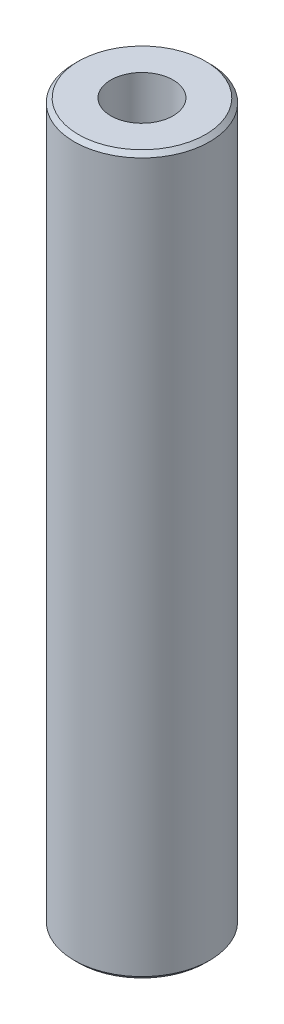
ISO-10303-21;
HEADER;
FILE_DESCRIPTION(('STEP AP214'),'2;1');
FILE_NAME('part.step','',(''),(''),'','','');
FILE_SCHEMA(('AUTOMOTIVE_DESIGN { 1 0 10303 214 1 1 1 1 }'));
ENDSEC;
DATA;
#1=APPLICATION_CONTEXT('core data for automotive mechanical design processes');
#2=APPLICATION_PROTOCOL_DEFINITION('international standard','automotive_design',2000,#1);
#3=PRODUCT_CONTEXT('',#1,'mechanical');
#4=PRODUCT('Part','Part','',(#3));
#5=PRODUCT_RELATED_PRODUCT_CATEGORY('part','',(#4));
#6=PRODUCT_DEFINITION_FORMATION('','',#4);
#7=PRODUCT_DEFINITION_CONTEXT('part definition',#1,'design');
#8=PRODUCT_DEFINITION('design','',#6,#7);
#9=PRODUCT_DEFINITION_SHAPE('','',#8);
#10=(LENGTH_UNIT() NAMED_UNIT(*) SI_UNIT(.MILLI.,.METRE.));
#11=(NAMED_UNIT(*) PLANE_ANGLE_UNIT() SI_UNIT($,.RADIAN.));
#12=(NAMED_UNIT(*) SI_UNIT($,.STERADIAN.) SOLID_ANGLE_UNIT());
#13=UNCERTAINTY_MEASURE_WITH_UNIT(LENGTH_MEASURE(1.E-05),#10,'distance_accuracy_value','');
#14=(GEOMETRIC_REPRESENTATION_CONTEXT(3) GLOBAL_UNCERTAINTY_ASSIGNED_CONTEXT((#13)) GLOBAL_UNIT_ASSIGNED_CONTEXT((#10,
#11,#12)) REPRESENTATION_CONTEXT('',''));
#15=CARTESIAN_POINT('',(0.,0.,0.));
#16=DIRECTION('',(0.,0.,1.));
#17=DIRECTION('',(1.,0.,0.));
#18=AXIS2_PLACEMENT_3D('',#15,#16,#17);
#19=CARTESIAN_POINT('',(0.,582.553141540625,0.));
#20=DIRECTION('',(0.,-1.,0.));
#21=DIRECTION('',(0.,0.,-1.));
#22=AXIS2_PLACEMENT_3D('',#19,#20,#21);
#23=CYLINDRICAL_SURFACE('',#22,55.);
#24=CARTESIAN_POINT('',(0.,579.159147282442,0.));
#25=DIRECTION('',(0.,1.,0.));
#26=DIRECTION('',(0.,0.,1.));
#27=AXIS2_PLACEMENT_3D('',#24,#25,#26);
#28=CIRCLE('',#27,55.);
#29=CARTESIAN_POINT('',(0.,579.159147282442,55.));
#30=VERTEX_POINT('',#29);
#31=EDGE_CURVE('E50',#30,#30,#28,.F.);
#32=ORIENTED_EDGE('',*,*,#31,.T.);
#33=EDGE_LOOP('',(#32));
#34=FACE_BOUND('',#33,.T.);
#35=CARTESIAN_POINT('',(0.,3.3939942581831,0.));
#36=DIRECTION('',(0.,1.,0.));
#37=DIRECTION('',(0.,0.,1.));
#38=AXIS2_PLACEMENT_3D('',#35,#36,#37);
#39=CIRCLE('',#38,55.);
#40=CARTESIAN_POINT('',(0.,3.3939942581831,55.));
#41=VERTEX_POINT('',#40);
#42=EDGE_CURVE('E51',#41,#41,#39,.T.);
#43=ORIENTED_EDGE('',*,*,#42,.T.);
#44=EDGE_LOOP('',(#43));
#45=FACE_BOUND('',#44,.T.);
#46=ADVANCED_FACE('F39',(#34,#45),#23,.T.);
#47=CARTESIAN_POINT('',(0.,582.553141540625,0.));
#48=DIRECTION('',(0.,1.,0.));
#49=DIRECTION('',(0.,0.,1.));
#50=AXIS2_PLACEMENT_3D('',#47,#48,#49);
#51=PLANE('',#50);
#52=CARTESIAN_POINT('',(0.,582.553141540625,0.));
#53=DIRECTION('',(0.,1.,0.));
#54=DIRECTION('',(0.,0.,1.));
#55=AXIS2_PLACEMENT_3D('',#52,#53,#54);
#56=CIRCLE('',#55,51.606005741817);
#57=CARTESIAN_POINT('',(0.,582.553141540625,51.606005741817));
#58=VERTEX_POINT('',#57);
#59=EDGE_CURVE('E54',#58,#58,#56,.T.);
#60=ORIENTED_EDGE('',*,*,#59,.T.);
#61=EDGE_LOOP('',(#60));
#62=FACE_BOUND('',#61,.T.);
#63=CARTESIAN_POINT('',(0.,582.553141540625,0.));
#64=DIRECTION('',(0.,1.,0.));
#65=DIRECTION('',(0.,0.,1.));
#66=AXIS2_PLACEMENT_3D('',#63,#64,#65);
#67=CIRCLE('',#66,25.284344183391);
#68=CARTESIAN_POINT('',(0.,582.553141540625,25.284344183391));
#69=VERTEX_POINT('',#68);
#70=EDGE_CURVE('E58',#69,#69,#67,.T.);
#71=ORIENTED_EDGE('',*,*,#70,.F.);
#72=EDGE_LOOP('',(#71));
#73=FACE_BOUND('',#72,.T.);
#74=ADVANCED_FACE('F69',(#62,#73),#51,.T.);
#75=CARTESIAN_POINT('',(0.,0.,0.));
#76=DIRECTION('',(0.,1.,0.));
#77=DIRECTION('',(0.,0.,1.));
#78=AXIS2_PLACEMENT_3D('',#75,#76,#77);
#79=PLANE('',#78);
#80=CARTESIAN_POINT('',(0.,0.,0.));
#81=DIRECTION('',(0.,1.,0.));
#82=DIRECTION('',(0.,0.,1.));
#83=AXIS2_PLACEMENT_3D('',#80,#81,#82);
#84=CIRCLE('',#83,51.6060057418168);
#85=CARTESIAN_POINT('',(0.,0.,51.6060057418168));
#86=VERTEX_POINT('',#85);
#87=EDGE_CURVE('E10',#86,#86,#84,.F.);
#88=ORIENTED_EDGE('',*,*,#87,.T.);
#89=EDGE_LOOP('',(#88));
#90=FACE_BOUND('',#89,.T.);
#91=CARTESIAN_POINT('',(0.,0.,0.));
#92=DIRECTION('',(0.,1.,0.));
#93=DIRECTION('',(0.,0.,1.));
#94=AXIS2_PLACEMENT_3D('',#91,#92,#93);
#95=CIRCLE('',#94,25.284344183391);
#96=CARTESIAN_POINT('',(0.,0.,25.284344183391));
#97=VERTEX_POINT('',#96);
#98=EDGE_CURVE('E63',#97,#97,#95,.T.);
#99=ORIENTED_EDGE('',*,*,#98,.T.);
#100=EDGE_LOOP('',(#99));
#101=FACE_BOUND('',#100,.T.);
#102=ADVANCED_FACE('F75',(#90,#101),#79,.F.);
#103=CARTESIAN_POINT('',(0.,582.553141540625,0.));
#104=DIRECTION('',(0.,-1.,0.));
#105=DIRECTION('',(0.,0.,-1.));
#106=AXIS2_PLACEMENT_3D('',#103,#104,#105);
#107=CYLINDRICAL_SURFACE('',#106,25.284344183391);
#108=ORIENTED_EDGE('',*,*,#70,.T.);
#109=EDGE_LOOP('',(#108));
#110=FACE_BOUND('',#109,.T.);
#111=ORIENTED_EDGE('',*,*,#98,.F.);
#112=EDGE_LOOP('',(#111));
#113=FACE_BOUND('',#112,.T.);
#114=ADVANCED_FACE('F70',(#110,#113),#107,.F.);
#115=CARTESIAN_POINT('',(0.,582.553141540625,0.));
#116=DIRECTION('',(0.,-1.,0.));
#117=DIRECTION('',(0.,0.,-1.));
#118=AXIS2_PLACEMENT_3D('',#115,#116,#117);
#119=CONICAL_SURFACE('',#118,51.606005741817,0.785398163397432);
#120=ORIENTED_EDGE('',*,*,#31,.F.);
#121=EDGE_LOOP('',(#120));
#122=FACE_BOUND('',#121,.T.);
#123=ORIENTED_EDGE('',*,*,#59,.F.);
#124=EDGE_LOOP('',(#123));
#125=FACE_BOUND('',#124,.T.);
#126=ADVANCED_FACE('F81',(#122,#125),#119,.T.);
#127=CARTESIAN_POINT('',(0.,3.3939942581831,0.));
#128=DIRECTION('',(0.,1.,0.));
#129=DIRECTION('',(0.,0.,1.));
#130=AXIS2_PLACEMENT_3D('',#127,#128,#129);
#131=CONICAL_SURFACE('',#130,55.,0.785398163397457);
#132=ORIENTED_EDGE('',*,*,#87,.F.);
#133=EDGE_LOOP('',(#132));
#134=FACE_BOUND('',#133,.T.);
#135=ORIENTED_EDGE('',*,*,#42,.F.);
#136=EDGE_LOOP('',(#135));
#137=FACE_BOUND('',#136,.T.);
#138=ADVANCED_FACE('F45',(#134,#137),#131,.T.);
#139=CLOSED_SHELL('',(#46,#74,#102,#114,#126,#138));
#140=MANIFOLD_SOLID_BREP('B2',#139);
#141=ADVANCED_BREP_SHAPE_REPRESENTATION('',(#18,#140),#14);
#142=SHAPE_DEFINITION_REPRESENTATION(#9,#141);
ENDSEC;
END-ISO-10303-21;
